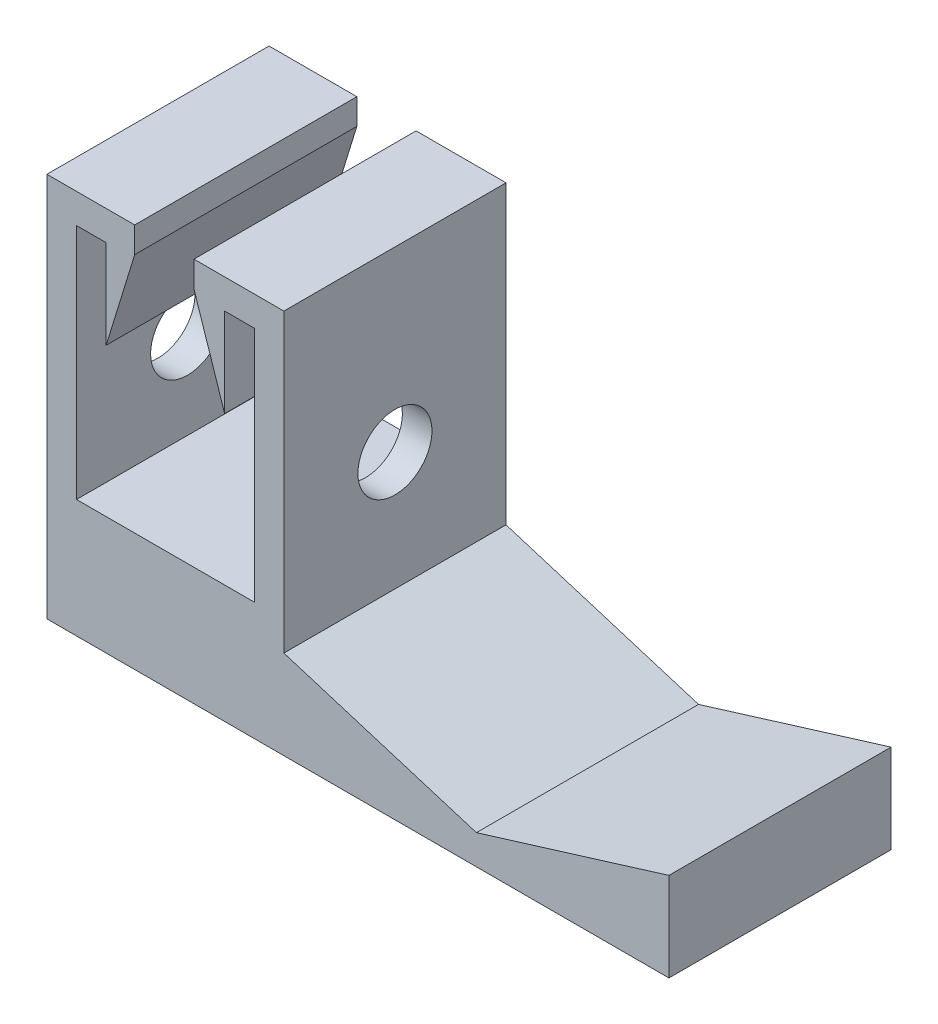
ISO-10303-21;
HEADER;
FILE_DESCRIPTION(('STEP AP214'),'2;1');
FILE_NAME('part.step','',(''),(''),'','','');
FILE_SCHEMA(('AUTOMOTIVE_DESIGN { 1 0 10303 214 1 1 1 1 }'));
ENDSEC;
DATA;
#1=APPLICATION_CONTEXT('core data for automotive mechanical design processes');
#2=APPLICATION_PROTOCOL_DEFINITION('international standard','automotive_design',2000,#1);
#3=PRODUCT_CONTEXT('',#1,'mechanical');
#4=PRODUCT('Part','Part','',(#3));
#5=PRODUCT_RELATED_PRODUCT_CATEGORY('part','',(#4));
#6=PRODUCT_DEFINITION_FORMATION('','',#4);
#7=PRODUCT_DEFINITION_CONTEXT('part definition',#1,'design');
#8=PRODUCT_DEFINITION('design','',#6,#7);
#9=PRODUCT_DEFINITION_SHAPE('','',#8);
#10=(LENGTH_UNIT() NAMED_UNIT(*) SI_UNIT(.MILLI.,.METRE.));
#11=(NAMED_UNIT(*) PLANE_ANGLE_UNIT() SI_UNIT($,.RADIAN.));
#12=(NAMED_UNIT(*) SI_UNIT($,.STERADIAN.) SOLID_ANGLE_UNIT());
#13=UNCERTAINTY_MEASURE_WITH_UNIT(LENGTH_MEASURE(1.E-05),#10,'distance_accuracy_value','');
#14=(GEOMETRIC_REPRESENTATION_CONTEXT(3) GLOBAL_UNCERTAINTY_ASSIGNED_CONTEXT((#13)) GLOBAL_UNIT_ASSIGNED_CONTEXT((#10,
#11,#12)) REPRESENTATION_CONTEXT('',''));
#15=CARTESIAN_POINT('',(0.,0.,0.));
#16=DIRECTION('',(0.,0.,1.));
#17=DIRECTION('',(1.,0.,0.));
#18=AXIS2_PLACEMENT_3D('',#15,#16,#17);
#19=CARTESIAN_POINT('',(0.,39.909181494662,37.5));
#20=DIRECTION('',(0.,1.,0.));
#21=DIRECTION('',(0.,0.,1.));
#22=AXIS2_PLACEMENT_3D('',#19,#20,#21);
#23=PLANE('',#22);
#24=DIRECTION('',(1.,0.,0.));
#25=VECTOR('',#24,1.);
#26=CARTESIAN_POINT('',(0.,39.909181494662,-37.5));
#27=LINE('',#26,#25);
#28=CARTESIAN_POINT('',(-95.,39.909181494662,-37.5));
#29=VERTEX_POINT('',#28);
#30=CARTESIAN_POINT('',(-35.,39.909181494662,-37.5));
#31=VERTEX_POINT('',#30);
#32=EDGE_CURVE('E192',#29,#31,#27,.T.);
#33=ORIENTED_EDGE('',*,*,#32,.F.);
#34=DIRECTION('',(0.,0.,-1.));
#35=VECTOR('',#34,1.);
#36=CARTESIAN_POINT('',(-95.,39.909181494662,37.5));
#37=LINE('',#36,#35);
#38=CARTESIAN_POINT('',(-95.,39.909181494662,37.5));
#39=VERTEX_POINT('',#38);
#40=EDGE_CURVE('E11',#39,#29,#37,.T.);
#41=ORIENTED_EDGE('',*,*,#40,.F.);
#42=DIRECTION('',(1.,0.,0.));
#43=VECTOR('',#42,1.);
#44=CARTESIAN_POINT('',(0.,39.909181494662,37.5));
#45=LINE('',#44,#43);
#46=CARTESIAN_POINT('',(-35.,39.909181494662,37.5));
#47=VERTEX_POINT('',#46);
#48=EDGE_CURVE('E235',#39,#47,#45,.T.);
#49=ORIENTED_EDGE('',*,*,#48,.T.);
#50=DIRECTION('',(0.,0.,-1.));
#51=VECTOR('',#50,1.);
#52=CARTESIAN_POINT('',(-35.,39.909181494662,37.5));
#53=LINE('',#52,#51);
#54=EDGE_CURVE('E118',#47,#31,#53,.T.);
#55=ORIENTED_EDGE('',*,*,#54,.T.);
#56=EDGE_LOOP('',(#33,#41,#49,#55));
#57=FACE_BOUND('',#56,.T.);
#58=ADVANCED_FACE('F33',(#57),#23,.T.);
#59=CARTESIAN_POINT('',(-95.,0.,37.5));
#60=DIRECTION('',(1.,0.,0.));
#61=DIRECTION('',(0.,1.,0.));
#62=AXIS2_PLACEMENT_3D('',#59,#60,#61);
#63=PLANE('',#62);
#64=CARTESIAN_POINT('',(-95.,70.,0.));
#65=DIRECTION('',(1.,0.,0.));
#66=DIRECTION('',(0.,1.,0.));
#67=AXIS2_PLACEMENT_3D('',#64,#65,#66);
#68=CIRCLE('',#67,12.5);
#69=CARTESIAN_POINT('',(-95.,82.5,0.));
#70=VERTEX_POINT('',#69);
#71=EDGE_CURVE('E196',#70,#70,#68,.T.);
#72=ORIENTED_EDGE('',*,*,#71,.F.);
#73=EDGE_LOOP('',(#72));
#74=FACE_BOUND('',#73,.T.);
#75=DIRECTION('',(0.,-1.,0.));
#76=VECTOR('',#75,1.);
#77=CARTESIAN_POINT('',(-95.,0.,-37.5));
#78=LINE('',#77,#76);
#79=CARTESIAN_POINT('',(-95.,120.,-37.5));
#80=VERTEX_POINT('',#79);
#81=EDGE_CURVE('E195',#80,#29,#78,.T.);
#82=ORIENTED_EDGE('',*,*,#81,.F.);
#83=DIRECTION('',(0.,0.,-1.));
#84=VECTOR('',#83,1.);
#85=CARTESIAN_POINT('',(-95.,120.,37.5));
#86=LINE('',#85,#84);
#87=CARTESIAN_POINT('',(-95.,120.,37.5));
#88=VERTEX_POINT('',#87);
#89=EDGE_CURVE('E42',#88,#80,#86,.T.);
#90=ORIENTED_EDGE('',*,*,#89,.F.);
#91=DIRECTION('',(0.,-1.,0.));
#92=VECTOR('',#91,1.);
#93=CARTESIAN_POINT('',(-95.,0.,37.5));
#94=LINE('',#93,#92);
#95=EDGE_CURVE('E296',#88,#39,#94,.T.);
#96=ORIENTED_EDGE('',*,*,#95,.T.);
#97=ORIENTED_EDGE('',*,*,#40,.T.);
#98=EDGE_LOOP('',(#82,#90,#96,#97));
#99=FACE_BOUND('',#98,.T.);
#100=ADVANCED_FACE('F284',(#74,#99),#63,.T.);
#101=CARTESIAN_POINT('',(0.,120.,37.5));
#102=DIRECTION('',(0.,-1.,0.));
#103=DIRECTION('',(0.,0.,-1.));
#104=AXIS2_PLACEMENT_3D('',#101,#102,#103);
#105=PLANE('',#104);
#106=DIRECTION('',(-1.,0.,0.));
#107=VECTOR('',#106,1.);
#108=CARTESIAN_POINT('',(0.,120.,-37.5));
#109=LINE('',#108,#107);
#110=CARTESIAN_POINT('',(-85.,120.,-37.5));
#111=VERTEX_POINT('',#110);
#112=EDGE_CURVE('E199',#111,#80,#109,.T.);
#113=ORIENTED_EDGE('',*,*,#112,.F.);
#114=DIRECTION('',(0.,0.,-1.));
#115=VECTOR('',#114,1.);
#116=CARTESIAN_POINT('',(-85.,120.,37.5));
#117=LINE('',#116,#115);
#118=CARTESIAN_POINT('',(-85.,120.,37.5));
#119=VERTEX_POINT('',#118);
#120=EDGE_CURVE('E272',#119,#111,#117,.T.);
#121=ORIENTED_EDGE('',*,*,#120,.F.);
#122=DIRECTION('',(-1.,0.,0.));
#123=VECTOR('',#122,1.);
#124=CARTESIAN_POINT('',(0.,120.,37.5));
#125=LINE('',#124,#123);
#126=EDGE_CURVE('E280',#119,#88,#125,.T.);
#127=ORIENTED_EDGE('',*,*,#126,.T.);
#128=ORIENTED_EDGE('',*,*,#89,.T.);
#129=EDGE_LOOP('',(#113,#121,#127,#128));
#130=FACE_BOUND('',#129,.T.);
#131=ADVANCED_FACE('F278',(#130),#105,.T.);
#132=CARTESIAN_POINT('',(-85.,0.,37.5));
#133=DIRECTION('',(-1.,0.,0.));
#134=DIRECTION('',(0.,0.,1.));
#135=AXIS2_PLACEMENT_3D('',#132,#133,#134);
#136=PLANE('',#135);
#137=DIRECTION('',(0.,1.,0.));
#138=VECTOR('',#137,1.);
#139=CARTESIAN_POINT('',(-85.,0.,-37.5));
#140=LINE('',#139,#138);
#141=CARTESIAN_POINT('',(-85.,90.,-37.5));
#142=VERTEX_POINT('',#141);
#143=EDGE_CURVE('E202',#142,#111,#140,.T.);
#144=ORIENTED_EDGE('',*,*,#143,.F.);
#145=DIRECTION('',(0.,0.,-1.));
#146=VECTOR('',#145,1.);
#147=CARTESIAN_POINT('',(-85.,90.,37.5));
#148=LINE('',#147,#146);
#149=CARTESIAN_POINT('',(-85.,90.,37.5));
#150=VERTEX_POINT('',#149);
#151=EDGE_CURVE('E270',#150,#142,#148,.T.);
#152=ORIENTED_EDGE('',*,*,#151,.F.);
#153=DIRECTION('',(0.,1.,0.));
#154=VECTOR('',#153,1.);
#155=CARTESIAN_POINT('',(-85.,0.,37.5));
#156=LINE('',#155,#154);
#157=EDGE_CURVE('E295',#150,#119,#156,.T.);
#158=ORIENTED_EDGE('',*,*,#157,.T.);
#159=ORIENTED_EDGE('',*,*,#120,.T.);
#160=EDGE_LOOP('',(#144,#152,#158,#159));
#161=FACE_BOUND('',#160,.T.);
#162=ADVANCED_FACE('F291',(#161),#136,.T.);
#163=CARTESIAN_POINT('',(-102.945945945946,31.6756756756757,37.5));
#164=DIRECTION('',(-0.95577900872195,0.294085848837523,0.));
#165=DIRECTION('',(-0.294085848837523,-0.95577900872195,0.));
#166=AXIS2_PLACEMENT_3D('',#163,#164,#165);
#167=PLANE('',#166);
#168=DIRECTION('',(0.294085848837523,0.95577900872195,0.));
#169=VECTOR('',#168,1.);
#170=CARTESIAN_POINT('',(-102.945945945946,31.6756756756757,-37.5));
#171=LINE('',#170,#169);
#172=CARTESIAN_POINT('',(-75.365508707511,121.312096700589,-37.5));
#173=VERTEX_POINT('',#172);
#174=EDGE_CURVE('E205',#142,#173,#171,.T.);
#175=ORIENTED_EDGE('',*,*,#174,.T.);
#176=DIRECTION('',(0.,0.,-1.));
#177=VECTOR('',#176,1.);
#178=CARTESIAN_POINT('',(-75.365508707511,121.312096700589,37.5));
#179=LINE('',#178,#177);
#180=CARTESIAN_POINT('',(-75.365508707511,121.312096700589,37.5));
#181=VERTEX_POINT('',#180);
#182=EDGE_CURVE('E267',#181,#173,#179,.T.);
#183=ORIENTED_EDGE('',*,*,#182,.F.);
#184=DIRECTION('',(0.294085848837523,0.95577900872195,0.));
#185=VECTOR('',#184,1.);
#186=CARTESIAN_POINT('',(-102.945945945946,31.6756756756757,37.5));
#187=LINE('',#186,#185);
#188=EDGE_CURVE('E298',#150,#181,#187,.T.);
#189=ORIENTED_EDGE('',*,*,#188,.F.);
#190=ORIENTED_EDGE('',*,*,#151,.T.);
#191=EDGE_LOOP('',(#175,#183,#189,#190));
#192=FACE_BOUND('',#191,.T.);
#193=ADVANCED_FACE('F390',(#192),#167,.F.);
#194=CARTESIAN_POINT('',(-75.365508707511,0.,37.5));
#195=DIRECTION('',(-1.,0.,0.));
#196=DIRECTION('',(0.,0.,1.));
#197=AXIS2_PLACEMENT_3D('',#194,#195,#196);
#198=PLANE('',#197);
#199=DIRECTION('',(0.,1.,0.));
#200=VECTOR('',#199,1.);
#201=CARTESIAN_POINT('',(-75.365508707511,0.,-37.5));
#202=LINE('',#201,#200);
#203=CARTESIAN_POINT('',(-75.365508707511,130.,-37.5));
#204=VERTEX_POINT('',#203);
#205=EDGE_CURVE('E207',#173,#204,#202,.T.);
#206=ORIENTED_EDGE('',*,*,#205,.T.);
#207=DIRECTION('',(0.,0.,-1.));
#208=VECTOR('',#207,1.);
#209=CARTESIAN_POINT('',(-75.365508707511,130.,37.5));
#210=LINE('',#209,#208);
#211=CARTESIAN_POINT('',(-75.365508707511,130.,37.5));
#212=VERTEX_POINT('',#211);
#213=EDGE_CURVE('E264',#212,#204,#210,.T.);
#214=ORIENTED_EDGE('',*,*,#213,.F.);
#215=DIRECTION('',(0.,1.,0.));
#216=VECTOR('',#215,1.);
#217=CARTESIAN_POINT('',(-75.365508707511,0.,37.5));
#218=LINE('',#217,#216);
#219=EDGE_CURVE('E304',#181,#212,#218,.T.);
#220=ORIENTED_EDGE('',*,*,#219,.F.);
#221=ORIENTED_EDGE('',*,*,#182,.T.);
#222=EDGE_LOOP('',(#206,#214,#220,#221));
#223=FACE_BOUND('',#222,.T.);
#224=ADVANCED_FACE('F393',(#223),#198,.F.);
#225=CARTESIAN_POINT('',(0.,130.,37.5));
#226=DIRECTION('',(0.,-1.,0.));
#227=DIRECTION('',(0.,0.,-1.));
#228=AXIS2_PLACEMENT_3D('',#225,#226,#227);
#229=PLANE('',#228);
#230=DIRECTION('',(-1.,0.,0.));
#231=VECTOR('',#230,1.);
#232=CARTESIAN_POINT('',(0.,130.,-37.5));
#233=LINE('',#232,#231);
#234=CARTESIAN_POINT('',(-105.,130.,-37.5));
#235=VERTEX_POINT('',#234);
#236=EDGE_CURVE('E209',#204,#235,#233,.T.);
#237=ORIENTED_EDGE('',*,*,#236,.T.);
#238=DIRECTION('',(0.,0.,-1.));
#239=VECTOR('',#238,1.);
#240=CARTESIAN_POINT('',(-105.,130.,37.5));
#241=LINE('',#240,#239);
#242=CARTESIAN_POINT('',(-105.,130.,37.5));
#243=VERTEX_POINT('',#242);
#244=EDGE_CURVE('E262',#243,#235,#241,.T.);
#245=ORIENTED_EDGE('',*,*,#244,.F.);
#246=DIRECTION('',(-1.,0.,0.));
#247=VECTOR('',#246,1.);
#248=CARTESIAN_POINT('',(0.,130.,37.5));
#249=LINE('',#248,#247);
#250=EDGE_CURVE('E306',#212,#243,#249,.T.);
#251=ORIENTED_EDGE('',*,*,#250,.F.);
#252=ORIENTED_EDGE('',*,*,#213,.T.);
#253=EDGE_LOOP('',(#237,#245,#251,#252));
#254=FACE_BOUND('',#253,.T.);
#255=ADVANCED_FACE('F397',(#254),#229,.F.);
#256=CARTESIAN_POINT('',(-105.,0.,37.5));
#257=DIRECTION('',(-1.,0.,0.));
#258=DIRECTION('',(0.,0.,1.));
#259=AXIS2_PLACEMENT_3D('',#256,#257,#258);
#260=PLANE('',#259);
#261=CARTESIAN_POINT('',(-105.,70.,0.));
#262=DIRECTION('',(-1.,0.,0.));
#263=DIRECTION('',(0.,0.,1.));
#264=AXIS2_PLACEMENT_3D('',#261,#262,#263);
#265=CIRCLE('',#264,12.5);
#266=CARTESIAN_POINT('',(-105.,70.,12.5));
#267=VERTEX_POINT('',#266);
#268=EDGE_CURVE('E343',#267,#267,#265,.T.);
#269=ORIENTED_EDGE('',*,*,#268,.F.);
#270=EDGE_LOOP('',(#269));
#271=FACE_BOUND('',#270,.T.);
#272=DIRECTION('',(0.,1.,0.));
#273=VECTOR('',#272,1.);
#274=CARTESIAN_POINT('',(-105.,0.,-37.5));
#275=LINE('',#274,#273);
#276=CARTESIAN_POINT('',(-105.,0.,-37.5));
#277=VERTEX_POINT('',#276);
#278=EDGE_CURVE('E212',#277,#235,#275,.T.);
#279=ORIENTED_EDGE('',*,*,#278,.F.);
#280=DIRECTION('',(0.,0.,-1.));
#281=VECTOR('',#280,1.);
#282=CARTESIAN_POINT('',(-105.,0.,37.5));
#283=LINE('',#282,#281);
#284=CARTESIAN_POINT('',(-105.,0.,37.5));
#285=VERTEX_POINT('',#284);
#286=EDGE_CURVE('E260',#285,#277,#283,.T.);
#287=ORIENTED_EDGE('',*,*,#286,.F.);
#288=DIRECTION('',(0.,1.,0.));
#289=VECTOR('',#288,1.);
#290=CARTESIAN_POINT('',(-105.,0.,37.5));
#291=LINE('',#290,#289);
#292=EDGE_CURVE('E308',#285,#243,#291,.T.);
#293=ORIENTED_EDGE('',*,*,#292,.T.);
#294=ORIENTED_EDGE('',*,*,#244,.T.);
#295=EDGE_LOOP('',(#279,#287,#293,#294));
#296=FACE_BOUND('',#295,.T.);
#297=ADVANCED_FACE('F401',(#271,#296),#260,.T.);
#298=CARTESIAN_POINT('',(0.,0.,37.5));
#299=DIRECTION('',(0.,1.,0.));
#300=DIRECTION('',(0.,0.,1.));
#301=AXIS2_PLACEMENT_3D('',#298,#299,#300);
#302=PLANE('',#301);
#303=DIRECTION('',(1.,0.,0.));
#304=VECTOR('',#303,1.);
#305=CARTESIAN_POINT('',(0.,0.,-37.5));
#306=LINE('',#305,#304);
#307=CARTESIAN_POINT('',(105.,0.,-37.5));
#308=VERTEX_POINT('',#307);
#309=EDGE_CURVE('E215',#277,#308,#306,.T.);
#310=ORIENTED_EDGE('',*,*,#309,.T.);
#311=DIRECTION('',(0.,0.,-1.));
#312=VECTOR('',#311,1.);
#313=CARTESIAN_POINT('',(105.,0.,37.5));
#314=LINE('',#313,#312);
#315=CARTESIAN_POINT('',(105.,0.,37.5));
#316=VERTEX_POINT('',#315);
#317=EDGE_CURVE('E257',#316,#308,#314,.T.);
#318=ORIENTED_EDGE('',*,*,#317,.F.);
#319=DIRECTION('',(1.,0.,0.));
#320=VECTOR('',#319,1.);
#321=CARTESIAN_POINT('',(0.,0.,37.5));
#322=LINE('',#321,#320);
#323=EDGE_CURVE('E311',#285,#316,#322,.T.);
#324=ORIENTED_EDGE('',*,*,#323,.F.);
#325=ORIENTED_EDGE('',*,*,#286,.T.);
#326=EDGE_LOOP('',(#310,#318,#324,#325));
#327=FACE_BOUND('',#326,.T.);
#328=ADVANCED_FACE('F405',(#327),#302,.F.);
#329=CARTESIAN_POINT('',(105.,0.,37.5));
#330=DIRECTION('',(-1.,0.,0.));
#331=DIRECTION('',(0.,0.,1.));
#332=AXIS2_PLACEMENT_3D('',#329,#330,#331);
#333=PLANE('',#332);
#334=DIRECTION('',(0.,1.,0.));
#335=VECTOR('',#334,1.);
#336=CARTESIAN_POINT('',(105.,0.,-37.5));
#337=LINE('',#336,#335);
#338=CARTESIAN_POINT('',(105.,30.,-37.5));
#339=VERTEX_POINT('',#338);
#340=EDGE_CURVE('E217',#308,#339,#337,.T.);
#341=ORIENTED_EDGE('',*,*,#340,.T.);
#342=DIRECTION('',(0.,0.,-1.));
#343=VECTOR('',#342,1.);
#344=CARTESIAN_POINT('',(105.,30.,37.5));
#345=LINE('',#344,#343);
#346=CARTESIAN_POINT('',(105.,30.,37.5));
#347=VERTEX_POINT('',#346);
#348=EDGE_CURVE('E254',#347,#339,#345,.T.);
#349=ORIENTED_EDGE('',*,*,#348,.F.);
#350=DIRECTION('',(0.,1.,0.));
#351=VECTOR('',#350,1.);
#352=CARTESIAN_POINT('',(105.,0.,37.5));
#353=LINE('',#352,#351);
#354=EDGE_CURVE('E313',#316,#347,#353,.T.);
#355=ORIENTED_EDGE('',*,*,#354,.F.);
#356=ORIENTED_EDGE('',*,*,#317,.T.);
#357=EDGE_LOOP('',(#341,#349,#355,#356));
#358=FACE_BOUND('',#357,.T.);
#359=ADVANCED_FACE('F409',(#358),#333,.F.);
#360=CARTESIAN_POINT('',(0.648648648648656,-2.10810810810813,37.5));
#361=DIRECTION('',(0.294085848837524,-0.95577900872195,0.));
#362=DIRECTION('',(0.95577900872195,0.294085848837524,0.));
#363=AXIS2_PLACEMENT_3D('',#360,#361,#362);
#364=PLANE('',#363);
#365=DIRECTION('',(-0.95577900872195,-0.294085848837524,0.));
#366=VECTOR('',#365,1.);
#367=CARTESIAN_POINT('',(0.648648648648656,-2.10810810810813,-37.5));
#368=LINE('',#367,#366);
#369=CARTESIAN_POINT('',(40.,10.,-37.5));
#370=VERTEX_POINT('',#369);
#371=EDGE_CURVE('E219',#339,#370,#368,.T.);
#372=ORIENTED_EDGE('',*,*,#371,.T.);
#373=DIRECTION('',(0.,0.,-1.));
#374=VECTOR('',#373,1.);
#375=CARTESIAN_POINT('',(40.,10.,37.5));
#376=LINE('',#375,#374);
#377=CARTESIAN_POINT('',(40.,10.,37.5));
#378=VERTEX_POINT('',#377);
#379=EDGE_CURVE('E251',#378,#370,#376,.T.);
#380=ORIENTED_EDGE('',*,*,#379,.F.);
#381=DIRECTION('',(-0.95577900872195,-0.294085848837524,0.));
#382=VECTOR('',#381,1.);
#383=CARTESIAN_POINT('',(0.648648648648656,-2.10810810810813,37.5));
#384=LINE('',#383,#382);
#385=EDGE_CURVE('E315',#347,#378,#384,.T.);
#386=ORIENTED_EDGE('',*,*,#385,.F.);
#387=ORIENTED_EDGE('',*,*,#348,.T.);
#388=EDGE_LOOP('',(#372,#380,#386,#387));
#389=FACE_BOUND('',#388,.T.);
#390=ADVANCED_FACE('F413',(#389),#364,.F.);
#391=CARTESIAN_POINT('',(6.27027027027027,20.3783783783784,37.5));
#392=DIRECTION('',(-0.294085848837523,-0.95577900872195,0.));
#393=DIRECTION('',(0.95577900872195,-0.294085848837523,0.));
#394=AXIS2_PLACEMENT_3D('',#391,#392,#393);
#395=PLANE('',#394);
#396=DIRECTION('',(-0.95577900872195,0.294085848837523,0.));
#397=VECTOR('',#396,1.);
#398=CARTESIAN_POINT('',(6.27027027027027,20.3783783783784,-37.5));
#399=LINE('',#398,#397);
#400=CARTESIAN_POINT('',(-25.,30.,-37.5));
#401=VERTEX_POINT('',#400);
#402=EDGE_CURVE('E221',#370,#401,#399,.T.);
#403=ORIENTED_EDGE('',*,*,#402,.T.);
#404=DIRECTION('',(0.,0.,-1.));
#405=VECTOR('',#404,1.);
#406=CARTESIAN_POINT('',(-25.,30.,37.5));
#407=LINE('',#406,#405);
#408=CARTESIAN_POINT('',(-25.,30.,37.5));
#409=VERTEX_POINT('',#408);
#410=EDGE_CURVE('E248',#409,#401,#407,.T.);
#411=ORIENTED_EDGE('',*,*,#410,.F.);
#412=DIRECTION('',(-0.95577900872195,0.294085848837523,0.));
#413=VECTOR('',#412,1.);
#414=CARTESIAN_POINT('',(6.27027027027027,20.3783783783784,37.5));
#415=LINE('',#414,#413);
#416=EDGE_CURVE('E317',#378,#409,#415,.T.);
#417=ORIENTED_EDGE('',*,*,#416,.F.);
#418=ORIENTED_EDGE('',*,*,#379,.T.);
#419=EDGE_LOOP('',(#403,#411,#417,#418));
#420=FACE_BOUND('',#419,.T.);
#421=ADVANCED_FACE('F362',(#420),#395,.F.);
#422=CARTESIAN_POINT('',(-25.,0.,37.5));
#423=DIRECTION('',(-1.,0.,0.));
#424=DIRECTION('',(0.,0.,1.));
#425=AXIS2_PLACEMENT_3D('',#422,#423,#424);
#426=PLANE('',#425);
#427=CARTESIAN_POINT('',(-25.,70.,0.));
#428=DIRECTION('',(-1.,0.,0.));
#429=DIRECTION('',(0.,0.,1.));
#430=AXIS2_PLACEMENT_3D('',#427,#428,#429);
#431=CIRCLE('',#430,12.5);
#432=CARTESIAN_POINT('',(-25.,70.,12.5));
#433=VERTEX_POINT('',#432);
#434=EDGE_CURVE('E340',#433,#433,#431,.T.);
#435=ORIENTED_EDGE('',*,*,#434,.T.);
#436=EDGE_LOOP('',(#435));
#437=FACE_BOUND('',#436,.T.);
#438=DIRECTION('',(0.,1.,0.));
#439=VECTOR('',#438,1.);
#440=CARTESIAN_POINT('',(-25.,0.,-37.5));
#441=LINE('',#440,#439);
#442=CARTESIAN_POINT('',(-25.,130.,-37.5));
#443=VERTEX_POINT('',#442);
#444=EDGE_CURVE('E223',#401,#443,#441,.T.);
#445=ORIENTED_EDGE('',*,*,#444,.T.);
#446=DIRECTION('',(0.,0.,-1.));
#447=VECTOR('',#446,1.);
#448=CARTESIAN_POINT('',(-25.,130.,37.5));
#449=LINE('',#448,#447);
#450=CARTESIAN_POINT('',(-25.,130.,37.5));
#451=VERTEX_POINT('',#450);
#452=EDGE_CURVE('E245',#451,#443,#449,.T.);
#453=ORIENTED_EDGE('',*,*,#452,.F.);
#454=DIRECTION('',(0.,1.,0.));
#455=VECTOR('',#454,1.);
#456=CARTESIAN_POINT('',(-25.,0.,37.5));
#457=LINE('',#456,#455);
#458=EDGE_CURVE('E319',#409,#451,#457,.T.);
#459=ORIENTED_EDGE('',*,*,#458,.F.);
#460=ORIENTED_EDGE('',*,*,#410,.T.);
#461=EDGE_LOOP('',(#445,#453,#459,#460));
#462=FACE_BOUND('',#461,.T.);
#463=ADVANCED_FACE('F358',(#437,#462),#426,.F.);
#464=CARTESIAN_POINT('',(0.,130.,37.5));
#465=DIRECTION('',(0.,-1.,0.));
#466=DIRECTION('',(0.,0.,-1.));
#467=AXIS2_PLACEMENT_3D('',#464,#465,#466);
#468=PLANE('',#467);
#469=DIRECTION('',(-1.,0.,0.));
#470=VECTOR('',#469,1.);
#471=CARTESIAN_POINT('',(0.,130.,-37.5));
#472=LINE('',#471,#470);
#473=CARTESIAN_POINT('',(-55.365508707511,130.,-37.5));
#474=VERTEX_POINT('',#473);
#475=EDGE_CURVE('E225',#443,#474,#472,.T.);
#476=ORIENTED_EDGE('',*,*,#475,.T.);
#477=DIRECTION('',(0.,0.,-1.));
#478=VECTOR('',#477,1.);
#479=CARTESIAN_POINT('',(-55.365508707511,130.,37.5));
#480=LINE('',#479,#478);
#481=CARTESIAN_POINT('',(-55.365508707511,130.,37.5));
#482=VERTEX_POINT('',#481);
#483=EDGE_CURVE('E242',#482,#474,#480,.T.);
#484=ORIENTED_EDGE('',*,*,#483,.F.);
#485=DIRECTION('',(-1.,0.,0.));
#486=VECTOR('',#485,1.);
#487=CARTESIAN_POINT('',(0.,130.,37.5));
#488=LINE('',#487,#486);
#489=EDGE_CURVE('E321',#451,#482,#488,.T.);
#490=ORIENTED_EDGE('',*,*,#489,.F.);
#491=ORIENTED_EDGE('',*,*,#452,.T.);
#492=EDGE_LOOP('',(#476,#484,#490,#491));
#493=FACE_BOUND('',#492,.T.);
#494=ADVANCED_FACE('F361',(#493),#468,.F.);
#495=CARTESIAN_POINT('',(-55.365508707511,0.,37.5));
#496=DIRECTION('',(1.,0.,0.));
#497=DIRECTION('',(0.,0.,-1.));
#498=AXIS2_PLACEMENT_3D('',#495,#496,#497);
#499=PLANE('',#498);
#500=DIRECTION('',(0.,-1.,0.));
#501=VECTOR('',#500,1.);
#502=CARTESIAN_POINT('',(-55.365508707511,0.,-37.5));
#503=LINE('',#502,#501);
#504=CARTESIAN_POINT('',(-55.365508707511,121.312096700589,-37.5));
#505=VERTEX_POINT('',#504);
#506=EDGE_CURVE('E227',#474,#505,#503,.T.);
#507=ORIENTED_EDGE('',*,*,#506,.T.);
#508=DIRECTION('',(0.,0.,-1.));
#509=VECTOR('',#508,1.);
#510=CARTESIAN_POINT('',(-55.365508707511,121.312096700589,37.5));
#511=LINE('',#510,#509);
#512=CARTESIAN_POINT('',(-55.365508707511,121.312096700589,37.5));
#513=VERTEX_POINT('',#512);
#514=EDGE_CURVE('E239',#513,#505,#511,.T.);
#515=ORIENTED_EDGE('',*,*,#514,.F.);
#516=DIRECTION('',(0.,-1.,0.));
#517=VECTOR('',#516,1.);
#518=CARTESIAN_POINT('',(-55.365508707511,0.,37.5));
#519=LINE('',#518,#517);
#520=EDGE_CURVE('E323',#482,#513,#519,.T.);
#521=ORIENTED_EDGE('',*,*,#520,.F.);
#522=ORIENTED_EDGE('',*,*,#483,.T.);
#523=EDGE_LOOP('',(#507,#515,#521,#522));
#524=FACE_BOUND('',#523,.T.);
#525=ADVANCED_FACE('F329',(#524),#499,.F.);
#526=CARTESIAN_POINT('',(-13.70468885487,-4.53677928428888,37.5));
#527=DIRECTION('',(0.949334848836449,0.314266359613428,0.));
#528=DIRECTION('',(-0.314266359613428,0.949334848836449,0.));
#529=AXIS2_PLACEMENT_3D('',#526,#527,#528);
#530=PLANE('',#529);
#531=DIRECTION('',(0.314266359613428,-0.949334848836449,0.));
#532=VECTOR('',#531,1.);
#533=CARTESIAN_POINT('',(-13.70468885487,-4.53677928428888,-37.5));
#534=LINE('',#533,#532);
#535=CARTESIAN_POINT('',(-45.,90.,-37.5));
#536=VERTEX_POINT('',#535);
#537=EDGE_CURVE('E229',#505,#536,#534,.T.);
#538=ORIENTED_EDGE('',*,*,#537,.T.);
#539=DIRECTION('',(0.,0.,-1.));
#540=VECTOR('',#539,1.);
#541=CARTESIAN_POINT('',(-45.,90.,37.5));
#542=LINE('',#541,#540);
#543=CARTESIAN_POINT('',(-45.,90.,37.5));
#544=VERTEX_POINT('',#543);
#545=EDGE_CURVE('E184',#544,#536,#542,.T.);
#546=ORIENTED_EDGE('',*,*,#545,.F.);
#547=DIRECTION('',(0.314266359613428,-0.949334848836449,0.));
#548=VECTOR('',#547,1.);
#549=CARTESIAN_POINT('',(-13.70468885487,-4.53677928428888,37.5));
#550=LINE('',#549,#548);
#551=EDGE_CURVE('E175',#513,#544,#550,.T.);
#552=ORIENTED_EDGE('',*,*,#551,.F.);
#553=ORIENTED_EDGE('',*,*,#514,.T.);
#554=EDGE_LOOP('',(#538,#546,#552,#553));
#555=FACE_BOUND('',#554,.T.);
#556=ADVANCED_FACE('F333',(#555),#530,.F.);
#557=CARTESIAN_POINT('',(-45.,0.,37.5));
#558=DIRECTION('',(-1.,0.,0.));
#559=DIRECTION('',(0.,-1.,0.));
#560=AXIS2_PLACEMENT_3D('',#557,#558,#559);
#561=PLANE('',#560);
#562=DIRECTION('',(0.,1.,0.));
#563=VECTOR('',#562,1.);
#564=CARTESIAN_POINT('',(-45.,0.,-37.5));
#565=LINE('',#564,#563);
#566=CARTESIAN_POINT('',(-45.,120.,-37.5));
#567=VERTEX_POINT('',#566);
#568=EDGE_CURVE('E183',#536,#567,#565,.T.);
#569=ORIENTED_EDGE('',*,*,#568,.T.);
#570=DIRECTION('',(0.,0.,-1.));
#571=VECTOR('',#570,1.);
#572=CARTESIAN_POINT('',(-45.,120.,37.5));
#573=LINE('',#572,#571);
#574=CARTESIAN_POINT('',(-45.,120.,37.5));
#575=VERTEX_POINT('',#574);
#576=EDGE_CURVE('E180',#575,#567,#573,.T.);
#577=ORIENTED_EDGE('',*,*,#576,.F.);
#578=DIRECTION('',(0.,1.,0.));
#579=VECTOR('',#578,1.);
#580=CARTESIAN_POINT('',(-45.,0.,37.5));
#581=LINE('',#580,#579);
#582=EDGE_CURVE('E169',#544,#575,#581,.T.);
#583=ORIENTED_EDGE('',*,*,#582,.F.);
#584=ORIENTED_EDGE('',*,*,#545,.T.);
#585=EDGE_LOOP('',(#569,#577,#583,#584));
#586=FACE_BOUND('',#585,.T.);
#587=ADVANCED_FACE('F181',(#586),#561,.F.);
#588=CARTESIAN_POINT('',(0.,120.,37.5));
#589=DIRECTION('',(0.,1.,0.));
#590=DIRECTION('',(0.,0.,1.));
#591=AXIS2_PLACEMENT_3D('',#588,#589,#590);
#592=PLANE('',#591);
#593=DIRECTION('',(1.,0.,0.));
#594=VECTOR('',#593,1.);
#595=CARTESIAN_POINT('',(0.,120.,-37.5));
#596=LINE('',#595,#594);
#597=CARTESIAN_POINT('',(-35.,120.,-37.5));
#598=VERTEX_POINT('',#597);
#599=EDGE_CURVE('E111',#567,#598,#596,.T.);
#600=ORIENTED_EDGE('',*,*,#599,.T.);
#601=DIRECTION('',(0.,0.,-1.));
#602=VECTOR('',#601,1.);
#603=CARTESIAN_POINT('',(-35.,120.,37.5));
#604=LINE('',#603,#602);
#605=CARTESIAN_POINT('',(-35.,120.,37.5));
#606=VERTEX_POINT('',#605);
#607=EDGE_CURVE('E185',#606,#598,#604,.T.);
#608=ORIENTED_EDGE('',*,*,#607,.F.);
#609=DIRECTION('',(1.,0.,0.));
#610=VECTOR('',#609,1.);
#611=CARTESIAN_POINT('',(0.,120.,37.5));
#612=LINE('',#611,#610);
#613=EDGE_CURVE('E173',#575,#606,#612,.T.);
#614=ORIENTED_EDGE('',*,*,#613,.F.);
#615=ORIENTED_EDGE('',*,*,#576,.T.);
#616=EDGE_LOOP('',(#600,#608,#614,#615));
#617=FACE_BOUND('',#616,.T.);
#618=ADVANCED_FACE('F187',(#617),#592,.F.);
#619=CARTESIAN_POINT('',(-35.,0.,37.5));
#620=DIRECTION('',(1.,0.,0.));
#621=DIRECTION('',(0.,1.,0.));
#622=AXIS2_PLACEMENT_3D('',#619,#620,#621);
#623=PLANE('',#622);
#624=CARTESIAN_POINT('',(-35.,70.,0.));
#625=DIRECTION('',(1.,0.,0.));
#626=DIRECTION('',(0.,1.,0.));
#627=AXIS2_PLACEMENT_3D('',#624,#625,#626);
#628=CIRCLE('',#627,12.5);
#629=CARTESIAN_POINT('',(-35.,82.5,0.));
#630=VERTEX_POINT('',#629);
#631=EDGE_CURVE('E36',#630,#630,#628,.T.);
#632=ORIENTED_EDGE('',*,*,#631,.T.);
#633=EDGE_LOOP('',(#632));
#634=FACE_BOUND('',#633,.T.);
#635=DIRECTION('',(0.,-1.,0.));
#636=VECTOR('',#635,1.);
#637=CARTESIAN_POINT('',(-35.,0.,-37.5));
#638=LINE('',#637,#636);
#639=EDGE_CURVE('E233',#598,#31,#638,.T.);
#640=ORIENTED_EDGE('',*,*,#639,.T.);
#641=ORIENTED_EDGE('',*,*,#54,.F.);
#642=DIRECTION('',(0.,-1.,0.));
#643=VECTOR('',#642,1.);
#644=CARTESIAN_POINT('',(-35.,0.,37.5));
#645=LINE('',#644,#643);
#646=EDGE_CURVE('E50',#606,#47,#645,.T.);
#647=ORIENTED_EDGE('',*,*,#646,.F.);
#648=ORIENTED_EDGE('',*,*,#607,.T.);
#649=EDGE_LOOP('',(#640,#641,#647,#648));
#650=FACE_BOUND('',#649,.T.);
#651=ADVANCED_FACE('F336',(#634,#650),#623,.F.);
#652=CARTESIAN_POINT('',(0.,0.,37.5));
#653=DIRECTION('',(0.,0.,1.));
#654=DIRECTION('',(1.,0.,0.));
#655=AXIS2_PLACEMENT_3D('',#652,#653,#654);
#656=PLANE('',#655);
#657=ORIENTED_EDGE('',*,*,#48,.F.);
#658=ORIENTED_EDGE('',*,*,#95,.F.);
#659=ORIENTED_EDGE('',*,*,#126,.F.);
#660=ORIENTED_EDGE('',*,*,#157,.F.);
#661=ORIENTED_EDGE('',*,*,#188,.T.);
#662=ORIENTED_EDGE('',*,*,#219,.T.);
#663=ORIENTED_EDGE('',*,*,#250,.T.);
#664=ORIENTED_EDGE('',*,*,#292,.F.);
#665=ORIENTED_EDGE('',*,*,#323,.T.);
#666=ORIENTED_EDGE('',*,*,#354,.T.);
#667=ORIENTED_EDGE('',*,*,#385,.T.);
#668=ORIENTED_EDGE('',*,*,#416,.T.);
#669=ORIENTED_EDGE('',*,*,#458,.T.);
#670=ORIENTED_EDGE('',*,*,#489,.T.);
#671=ORIENTED_EDGE('',*,*,#520,.T.);
#672=ORIENTED_EDGE('',*,*,#551,.T.);
#673=ORIENTED_EDGE('',*,*,#582,.T.);
#674=ORIENTED_EDGE('',*,*,#613,.T.);
#675=ORIENTED_EDGE('',*,*,#646,.T.);
#676=EDGE_LOOP('',(#657,#658,#659,#660,#661,#662,#663,#664,#665,#666,#667,#668,#669,#670,#671,
#672,#673,#674,#675));
#677=FACE_BOUND('',#676,.T.);
#678=ADVANCED_FACE('F171',(#677),#656,.T.);
#679=CARTESIAN_POINT('',(0.,0.,-37.5));
#680=DIRECTION('',(0.,0.,1.));
#681=DIRECTION('',(1.,0.,0.));
#682=AXIS2_PLACEMENT_3D('',#679,#680,#681);
#683=PLANE('',#682);
#684=ORIENTED_EDGE('',*,*,#32,.T.);
#685=ORIENTED_EDGE('',*,*,#639,.F.);
#686=ORIENTED_EDGE('',*,*,#599,.F.);
#687=ORIENTED_EDGE('',*,*,#568,.F.);
#688=ORIENTED_EDGE('',*,*,#537,.F.);
#689=ORIENTED_EDGE('',*,*,#506,.F.);
#690=ORIENTED_EDGE('',*,*,#475,.F.);
#691=ORIENTED_EDGE('',*,*,#444,.F.);
#692=ORIENTED_EDGE('',*,*,#402,.F.);
#693=ORIENTED_EDGE('',*,*,#371,.F.);
#694=ORIENTED_EDGE('',*,*,#340,.F.);
#695=ORIENTED_EDGE('',*,*,#309,.F.);
#696=ORIENTED_EDGE('',*,*,#278,.T.);
#697=ORIENTED_EDGE('',*,*,#236,.F.);
#698=ORIENTED_EDGE('',*,*,#205,.F.);
#699=ORIENTED_EDGE('',*,*,#174,.F.);
#700=ORIENTED_EDGE('',*,*,#143,.T.);
#701=ORIENTED_EDGE('',*,*,#112,.T.);
#702=ORIENTED_EDGE('',*,*,#81,.T.);
#703=EDGE_LOOP('',(#684,#685,#686,#687,#688,#689,#690,#691,#692,#693,#694,#695,#696,#697,#698,
#699,#700,#701,#702));
#704=FACE_BOUND('',#703,.T.);
#705=ADVANCED_FACE('F286',(#704),#683,.F.);
#706=CARTESIAN_POINT('',(-4.99999999999999,70.,0.));
#707=DIRECTION('',(-1.,0.,0.));
#708=DIRECTION('',(0.,0.,1.));
#709=AXIS2_PLACEMENT_3D('',#706,#707,#708);
#710=CYLINDRICAL_SURFACE('',#709,12.5);
#711=ORIENTED_EDGE('',*,*,#631,.F.);
#712=EDGE_LOOP('',(#711));
#713=FACE_BOUND('',#712,.T.);
#714=ORIENTED_EDGE('',*,*,#434,.F.);
#715=EDGE_LOOP('',(#714));
#716=FACE_BOUND('',#715,.T.);
#717=ADVANCED_FACE('F351',(#713,#716),#710,.F.);
#718=ORIENTED_EDGE('',*,*,#71,.T.);
#719=EDGE_LOOP('',(#718));
#720=FACE_BOUND('',#719,.T.);
#721=ORIENTED_EDGE('',*,*,#268,.T.);
#722=EDGE_LOOP('',(#721));
#723=FACE_BOUND('',#722,.T.);
#724=ADVANCED_FACE('F354',(#720,#723),#710,.F.);
#725=CLOSED_SHELL('',(#58,#100,#131,#162,#193,#224,#255,#297,#328,#359,#390,#421,#463,#494,#525,
#556,#587,#618,#651,#678,#705,#717,#724));
#726=MANIFOLD_SOLID_BREP('B2',#725);
#727=ADVANCED_BREP_SHAPE_REPRESENTATION('',(#18,#726),#14);
#728=SHAPE_DEFINITION_REPRESENTATION(#9,#727);
ENDSEC;
END-ISO-10303-21;
